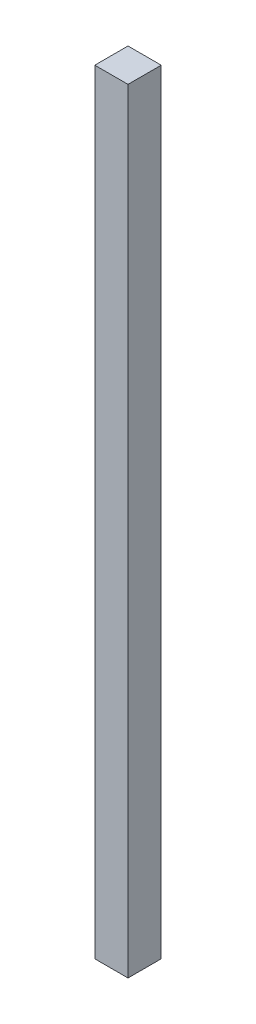
ISO-10303-21;
HEADER;
FILE_DESCRIPTION(('STEP AP214'),'2;1');
FILE_NAME('part.step','',(''),(''),'','','');
FILE_SCHEMA(('AUTOMOTIVE_DESIGN { 1 0 10303 214 1 1 1 1 }'));
ENDSEC;
DATA;
#1=APPLICATION_CONTEXT('core data for automotive mechanical design processes');
#2=APPLICATION_PROTOCOL_DEFINITION('international standard','automotive_design',2000,#1);
#3=PRODUCT_CONTEXT('',#1,'mechanical');
#4=PRODUCT('Part','Part','',(#3));
#5=PRODUCT_RELATED_PRODUCT_CATEGORY('part','',(#4));
#6=PRODUCT_DEFINITION_FORMATION('','',#4);
#7=PRODUCT_DEFINITION_CONTEXT('part definition',#1,'design');
#8=PRODUCT_DEFINITION('design','',#6,#7);
#9=PRODUCT_DEFINITION_SHAPE('','',#8);
#10=(LENGTH_UNIT() NAMED_UNIT(*) SI_UNIT(.MILLI.,.METRE.));
#11=(NAMED_UNIT(*) PLANE_ANGLE_UNIT() SI_UNIT($,.RADIAN.));
#12=(NAMED_UNIT(*) SI_UNIT($,.STERADIAN.) SOLID_ANGLE_UNIT());
#13=UNCERTAINTY_MEASURE_WITH_UNIT(LENGTH_MEASURE(1.E-05),#10,'distance_accuracy_value','');
#14=(GEOMETRIC_REPRESENTATION_CONTEXT(3) GLOBAL_UNCERTAINTY_ASSIGNED_CONTEXT((#13)) GLOBAL_UNIT_ASSIGNED_CONTEXT((#10,
#11,#12)) REPRESENTATION_CONTEXT('',''));
#15=CARTESIAN_POINT('',(0.,0.,0.));
#16=DIRECTION('',(0.,0.,1.));
#17=DIRECTION('',(1.,0.,0.));
#18=AXIS2_PLACEMENT_3D('',#15,#16,#17);
#19=CARTESIAN_POINT('',(-41.6666666666668,69.6428571428574,10.));
#20=DIRECTION('',(0.,-1.,0.));
#21=DIRECTION('',(0.,0.,-1.));
#22=AXIS2_PLACEMENT_3D('',#19,#20,#21);
#23=PLANE('',#22);
#24=DIRECTION('',(-1.,0.,0.));
#25=VECTOR('',#24,1.);
#26=CARTESIAN_POINT('',(-41.6666666666668,69.6428571428574,0.));
#27=LINE('',#26,#25);
#28=CARTESIAN_POINT('',(-41.6666666666668,69.6428571428574,0.));
#29=VERTEX_POINT('',#28);
#30=CARTESIAN_POINT('',(-51.6666666666668,69.6428571428574,0.));
#31=VERTEX_POINT('',#30);
#32=EDGE_CURVE('E96',#29,#31,#27,.T.);
#33=ORIENTED_EDGE('',*,*,#32,.T.);
#34=DIRECTION('',(0.,0.,-1.));
#35=VECTOR('',#34,1.);
#36=CARTESIAN_POINT('',(-51.6666666666668,69.6428571428574,10.));
#37=LINE('',#36,#35);
#38=CARTESIAN_POINT('',(-51.6666666666668,69.6428571428574,10.));
#39=VERTEX_POINT('',#38);
#40=EDGE_CURVE('E11',#39,#31,#37,.T.);
#41=ORIENTED_EDGE('',*,*,#40,.F.);
#42=DIRECTION('',(-1.,0.,0.));
#43=VECTOR('',#42,1.);
#44=CARTESIAN_POINT('',(-41.6666666666668,69.6428571428574,10.));
#45=LINE('',#44,#43);
#46=CARTESIAN_POINT('',(-41.6666666666668,69.6428571428574,10.));
#47=VERTEX_POINT('',#46);
#48=EDGE_CURVE('E82',#47,#39,#45,.T.);
#49=ORIENTED_EDGE('',*,*,#48,.F.);
#50=DIRECTION('',(0.,0.,-1.));
#51=VECTOR('',#50,1.);
#52=CARTESIAN_POINT('',(-41.6666666666668,69.6428571428574,10.));
#53=LINE('',#52,#51);
#54=EDGE_CURVE('E49',#47,#29,#53,.T.);
#55=ORIENTED_EDGE('',*,*,#54,.T.);
#56=EDGE_LOOP('',(#33,#41,#49,#55));
#57=FACE_BOUND('',#56,.T.);
#58=ADVANCED_FACE('F33',(#57),#23,.F.);
#59=CARTESIAN_POINT('',(-51.6666666666668,69.6428571428574,10.));
#60=DIRECTION('',(1.,0.,0.));
#61=DIRECTION('',(0.,1.,0.));
#62=AXIS2_PLACEMENT_3D('',#59,#60,#61);
#63=PLANE('',#62);
#64=DIRECTION('',(0.,-1.,0.));
#65=VECTOR('',#64,1.);
#66=CARTESIAN_POINT('',(-51.6666666666668,69.6428571428574,0.));
#67=LINE('',#66,#65);
#68=CARTESIAN_POINT('',(-51.6666666666668,-163.357142857143,0.));
#69=VERTEX_POINT('',#68);
#70=EDGE_CURVE('E87',#31,#69,#67,.T.);
#71=ORIENTED_EDGE('',*,*,#70,.T.);
#72=DIRECTION('',(0.,0.,-1.));
#73=VECTOR('',#72,1.);
#74=CARTESIAN_POINT('',(-51.6666666666668,-163.357142857143,10.));
#75=LINE('',#74,#73);
#76=CARTESIAN_POINT('',(-51.6666666666668,-163.357142857143,10.));
#77=VERTEX_POINT('',#76);
#78=EDGE_CURVE('E41',#77,#69,#75,.T.);
#79=ORIENTED_EDGE('',*,*,#78,.F.);
#80=DIRECTION('',(0.,-1.,0.));
#81=VECTOR('',#80,1.);
#82=CARTESIAN_POINT('',(-51.6666666666668,69.6428571428574,10.));
#83=LINE('',#82,#81);
#84=EDGE_CURVE('E74',#39,#77,#83,.T.);
#85=ORIENTED_EDGE('',*,*,#84,.F.);
#86=ORIENTED_EDGE('',*,*,#40,.T.);
#87=EDGE_LOOP('',(#71,#79,#85,#86));
#88=FACE_BOUND('',#87,.T.);
#89=ADVANCED_FACE('F86',(#88),#63,.F.);
#90=CARTESIAN_POINT('',(-41.6666666666668,-163.357142857143,10.));
#91=DIRECTION('',(0.,-1.,0.));
#92=DIRECTION('',(0.,0.,-1.));
#93=AXIS2_PLACEMENT_3D('',#90,#91,#92);
#94=PLANE('',#93);
#95=DIRECTION('',(-1.,0.,0.));
#96=VECTOR('',#95,1.);
#97=CARTESIAN_POINT('',(-41.6666666666668,-163.357142857143,0.));
#98=LINE('',#97,#96);
#99=CARTESIAN_POINT('',(-41.6666666666668,-163.357142857143,0.));
#100=VERTEX_POINT('',#99);
#101=EDGE_CURVE('E99',#100,#69,#98,.T.);
#102=ORIENTED_EDGE('',*,*,#101,.F.);
#103=DIRECTION('',(0.,0.,-1.));
#104=VECTOR('',#103,1.);
#105=CARTESIAN_POINT('',(-41.6666666666668,-163.357142857143,10.));
#106=LINE('',#105,#104);
#107=CARTESIAN_POINT('',(-41.6666666666668,-163.357142857143,10.));
#108=VERTEX_POINT('',#107);
#109=EDGE_CURVE('E63',#108,#100,#106,.T.);
#110=ORIENTED_EDGE('',*,*,#109,.F.);
#111=DIRECTION('',(-1.,0.,0.));
#112=VECTOR('',#111,1.);
#113=CARTESIAN_POINT('',(-41.6666666666668,-163.357142857143,10.));
#114=LINE('',#113,#112);
#115=EDGE_CURVE('E81',#108,#77,#114,.T.);
#116=ORIENTED_EDGE('',*,*,#115,.T.);
#117=ORIENTED_EDGE('',*,*,#78,.T.);
#118=EDGE_LOOP('',(#102,#110,#116,#117));
#119=FACE_BOUND('',#118,.T.);
#120=ADVANCED_FACE('F90',(#119),#94,.T.);
#121=CARTESIAN_POINT('',(-41.6666666666668,69.6428571428574,10.));
#122=DIRECTION('',(1.,0.,0.));
#123=DIRECTION('',(0.,1.,0.));
#124=AXIS2_PLACEMENT_3D('',#121,#122,#123);
#125=PLANE('',#124);
#126=DIRECTION('',(0.,-1.,0.));
#127=VECTOR('',#126,1.);
#128=CARTESIAN_POINT('',(-41.6666666666668,69.6428571428574,0.));
#129=LINE('',#128,#127);
#130=EDGE_CURVE('E101',#29,#100,#129,.T.);
#131=ORIENTED_EDGE('',*,*,#130,.F.);
#132=ORIENTED_EDGE('',*,*,#54,.F.);
#133=DIRECTION('',(0.,-1.,0.));
#134=VECTOR('',#133,1.);
#135=CARTESIAN_POINT('',(-41.6666666666668,69.6428571428574,10.));
#136=LINE('',#135,#134);
#137=EDGE_CURVE('E91',#47,#108,#136,.T.);
#138=ORIENTED_EDGE('',*,*,#137,.T.);
#139=ORIENTED_EDGE('',*,*,#109,.T.);
#140=EDGE_LOOP('',(#131,#132,#138,#139));
#141=FACE_BOUND('',#140,.T.);
#142=ADVANCED_FACE('F107',(#141),#125,.T.);
#143=CARTESIAN_POINT('',(0.,0.,10.));
#144=DIRECTION('',(0.,0.,1.));
#145=DIRECTION('',(1.,0.,0.));
#146=AXIS2_PLACEMENT_3D('',#143,#144,#145);
#147=PLANE('',#146);
#148=ORIENTED_EDGE('',*,*,#48,.T.);
#149=ORIENTED_EDGE('',*,*,#84,.T.);
#150=ORIENTED_EDGE('',*,*,#115,.F.);
#151=ORIENTED_EDGE('',*,*,#137,.F.);
#152=EDGE_LOOP('',(#148,#149,#150,#151));
#153=FACE_BOUND('',#152,.T.);
#154=ADVANCED_FACE('F78',(#153),#147,.T.);
#155=CARTESIAN_POINT('',(0.,0.,0.));
#156=DIRECTION('',(0.,0.,1.));
#157=DIRECTION('',(1.,0.,0.));
#158=AXIS2_PLACEMENT_3D('',#155,#156,#157);
#159=PLANE('',#158);
#160=ORIENTED_EDGE('',*,*,#32,.F.);
#161=ORIENTED_EDGE('',*,*,#130,.T.);
#162=ORIENTED_EDGE('',*,*,#101,.T.);
#163=ORIENTED_EDGE('',*,*,#70,.F.);
#164=EDGE_LOOP('',(#160,#161,#162,#163));
#165=FACE_BOUND('',#164,.T.);
#166=ADVANCED_FACE('F106',(#165),#159,.F.);
#167=CLOSED_SHELL('',(#58,#89,#120,#142,#154,#166));
#168=MANIFOLD_SOLID_BREP('B2',#167);
#169=ADVANCED_BREP_SHAPE_REPRESENTATION('',(#18,#168),#14);
#170=SHAPE_DEFINITION_REPRESENTATION(#9,#169);
ENDSEC;
END-ISO-10303-21;
